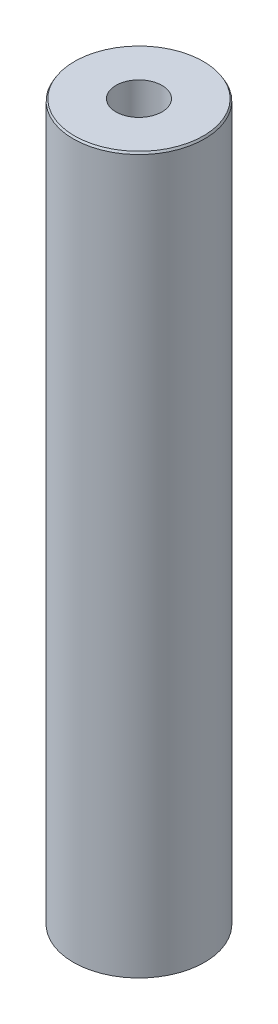
ISO-10303-21;
HEADER;
FILE_DESCRIPTION(('STEP AP214'),'2;1');
FILE_NAME('part.step','',(''),(''),'','','');
FILE_SCHEMA(('AUTOMOTIVE_DESIGN { 1 0 10303 214 1 1 1 1 }'));
ENDSEC;
DATA;
#1=APPLICATION_CONTEXT('core data for automotive mechanical design processes');
#2=APPLICATION_PROTOCOL_DEFINITION('international standard','automotive_design',2000,#1);
#3=PRODUCT_CONTEXT('',#1,'mechanical');
#4=PRODUCT('Part','Part','',(#3));
#5=PRODUCT_RELATED_PRODUCT_CATEGORY('part','',(#4));
#6=PRODUCT_DEFINITION_FORMATION('','',#4);
#7=PRODUCT_DEFINITION_CONTEXT('part definition',#1,'design');
#8=PRODUCT_DEFINITION('design','',#6,#7);
#9=PRODUCT_DEFINITION_SHAPE('','',#8);
#10=(LENGTH_UNIT() NAMED_UNIT(*) SI_UNIT(.MILLI.,.METRE.));
#11=(NAMED_UNIT(*) PLANE_ANGLE_UNIT() SI_UNIT($,.RADIAN.));
#12=(NAMED_UNIT(*) SI_UNIT($,.STERADIAN.) SOLID_ANGLE_UNIT());
#13=UNCERTAINTY_MEASURE_WITH_UNIT(LENGTH_MEASURE(1.E-05),#10,'distance_accuracy_value','');
#14=(GEOMETRIC_REPRESENTATION_CONTEXT(3) GLOBAL_UNCERTAINTY_ASSIGNED_CONTEXT((#13)) GLOBAL_UNIT_ASSIGNED_CONTEXT((#10,
#11,#12)) REPRESENTATION_CONTEXT('',''));
#15=CARTESIAN_POINT('',(0.,0.,0.));
#16=DIRECTION('',(0.,0.,1.));
#17=DIRECTION('',(1.,0.,0.));
#18=AXIS2_PLACEMENT_3D('',#15,#16,#17);
#19=CARTESIAN_POINT('',(0.,600.,0.));
#20=DIRECTION('',(0.,-1.,0.));
#21=DIRECTION('',(0.,0.,-1.));
#22=AXIS2_PLACEMENT_3D('',#19,#20,#21);
#23=CYLINDRICAL_SURFACE('',#22,55.);
#24=CARTESIAN_POINT('',(0.,598.2978217125,0.));
#25=DIRECTION('',(0.,1.,0.));
#26=DIRECTION('',(0.,0.,1.));
#27=AXIS2_PLACEMENT_3D('',#24,#25,#26);
#28=CIRCLE('',#27,55.);
#29=CARTESIAN_POINT('',(0.,598.2978217125,55.));
#30=VERTEX_POINT('',#29);
#31=EDGE_CURVE('E50',#30,#30,#28,.F.);
#32=ORIENTED_EDGE('',*,*,#31,.T.);
#33=EDGE_LOOP('',(#32));
#34=FACE_BOUND('',#33,.T.);
#35=CARTESIAN_POINT('',(0.,0.982753092496291,0.));
#36=DIRECTION('',(0.,1.,0.));
#37=DIRECTION('',(0.,0.,1.));
#38=AXIS2_PLACEMENT_3D('',#35,#36,#37);
#39=CIRCLE('',#38,55.);
#40=CARTESIAN_POINT('',(0.,0.982753092496291,55.));
#41=VERTEX_POINT('',#40);
#42=EDGE_CURVE('E51',#41,#41,#39,.T.);
#43=ORIENTED_EDGE('',*,*,#42,.T.);
#44=EDGE_LOOP('',(#43));
#45=FACE_BOUND('',#44,.T.);
#46=ADVANCED_FACE('F39',(#34,#45),#23,.T.);
#47=CARTESIAN_POINT('',(0.,600.,0.));
#48=DIRECTION('',(0.,1.,0.));
#49=DIRECTION('',(0.,0.,1.));
#50=AXIS2_PLACEMENT_3D('',#47,#48,#49);
#51=PLANE('',#50);
#52=CARTESIAN_POINT('',(0.,600.,0.));
#53=DIRECTION('',(0.,1.,0.));
#54=DIRECTION('',(0.,0.,1.));
#55=AXIS2_PLACEMENT_3D('',#52,#53,#54);
#56=CIRCLE('',#55,54.0172469075034);
#57=CARTESIAN_POINT('',(0.,600.,54.0172469075034));
#58=VERTEX_POINT('',#57);
#59=EDGE_CURVE('E54',#58,#58,#56,.T.);
#60=ORIENTED_EDGE('',*,*,#59,.T.);
#61=EDGE_LOOP('',(#60));
#62=FACE_BOUND('',#61,.T.);
#63=CARTESIAN_POINT('',(0.,600.,0.));
#64=DIRECTION('',(0.,1.,0.));
#65=DIRECTION('',(0.,0.,1.));
#66=AXIS2_PLACEMENT_3D('',#63,#64,#65);
#67=CIRCLE('',#66,19.278740833856);
#68=CARTESIAN_POINT('',(0.,600.,19.278740833856));
#69=VERTEX_POINT('',#68);
#70=EDGE_CURVE('E58',#69,#69,#67,.T.);
#71=ORIENTED_EDGE('',*,*,#70,.F.);
#72=EDGE_LOOP('',(#71));
#73=FACE_BOUND('',#72,.T.);
#74=ADVANCED_FACE('F69',(#62,#73),#51,.T.);
#75=CARTESIAN_POINT('',(0.,0.,0.));
#76=DIRECTION('',(0.,1.,0.));
#77=DIRECTION('',(0.,0.,1.));
#78=AXIS2_PLACEMENT_3D('',#75,#76,#77);
#79=PLANE('',#78);
#80=CARTESIAN_POINT('',(0.,0.,0.));
#81=DIRECTION('',(0.,1.,0.));
#82=DIRECTION('',(0.,0.,1.));
#83=AXIS2_PLACEMENT_3D('',#80,#81,#82);
#84=CIRCLE('',#83,53.2978217125009);
#85=CARTESIAN_POINT('',(0.,0.,53.2978217125009));
#86=VERTEX_POINT('',#85);
#87=EDGE_CURVE('E10',#86,#86,#84,.F.);
#88=ORIENTED_EDGE('',*,*,#87,.T.);
#89=EDGE_LOOP('',(#88));
#90=FACE_BOUND('',#89,.T.);
#91=CARTESIAN_POINT('',(0.,0.,0.));
#92=DIRECTION('',(0.,1.,0.));
#93=DIRECTION('',(0.,0.,1.));
#94=AXIS2_PLACEMENT_3D('',#91,#92,#93);
#95=CIRCLE('',#94,19.278740833856);
#96=CARTESIAN_POINT('',(0.,0.,19.278740833856));
#97=VERTEX_POINT('',#96);
#98=EDGE_CURVE('E63',#97,#97,#95,.T.);
#99=ORIENTED_EDGE('',*,*,#98,.T.);
#100=EDGE_LOOP('',(#99));
#101=FACE_BOUND('',#100,.T.);
#102=ADVANCED_FACE('F75',(#90,#101),#79,.F.);
#103=CARTESIAN_POINT('',(0.,600.,0.));
#104=DIRECTION('',(0.,-1.,0.));
#105=DIRECTION('',(0.,0.,-1.));
#106=AXIS2_PLACEMENT_3D('',#103,#104,#105);
#107=CYLINDRICAL_SURFACE('',#106,19.278740833856);
#108=ORIENTED_EDGE('',*,*,#70,.T.);
#109=EDGE_LOOP('',(#108));
#110=FACE_BOUND('',#109,.T.);
#111=ORIENTED_EDGE('',*,*,#98,.F.);
#112=EDGE_LOOP('',(#111));
#113=FACE_BOUND('',#112,.T.);
#114=ADVANCED_FACE('F70',(#110,#113),#107,.F.);
#115=CARTESIAN_POINT('',(0.,600.,0.));
#116=DIRECTION('',(0.,-1.,0.));
#117=DIRECTION('',(0.,0.,-1.));
#118=AXIS2_PLACEMENT_3D('',#115,#116,#117);
#119=CONICAL_SURFACE('',#118,54.0172469075034,0.523598775598294);
#120=ORIENTED_EDGE('',*,*,#31,.F.);
#121=EDGE_LOOP('',(#120));
#122=FACE_BOUND('',#121,.T.);
#123=ORIENTED_EDGE('',*,*,#59,.F.);
#124=EDGE_LOOP('',(#123));
#125=FACE_BOUND('',#124,.T.);
#126=ADVANCED_FACE('F81',(#122,#125),#119,.T.);
#127=CARTESIAN_POINT('',(0.,0.982753092496291,0.));
#128=DIRECTION('',(0.,1.,0.));
#129=DIRECTION('',(0.,0.,1.));
#130=AXIS2_PLACEMENT_3D('',#127,#128,#129);
#131=CONICAL_SURFACE('',#130,55.,1.04719755119662);
#132=ORIENTED_EDGE('',*,*,#87,.F.);
#133=EDGE_LOOP('',(#132));
#134=FACE_BOUND('',#133,.T.);
#135=ORIENTED_EDGE('',*,*,#42,.F.);
#136=EDGE_LOOP('',(#135));
#137=FACE_BOUND('',#136,.T.);
#138=ADVANCED_FACE('F45',(#134,#137),#131,.T.);
#139=CLOSED_SHELL('',(#46,#74,#102,#114,#126,#138));
#140=MANIFOLD_SOLID_BREP('B2',#139);
#141=ADVANCED_BREP_SHAPE_REPRESENTATION('',(#18,#140),#14);
#142=SHAPE_DEFINITION_REPRESENTATION(#9,#141);
ENDSEC;
END-ISO-10303-21;
